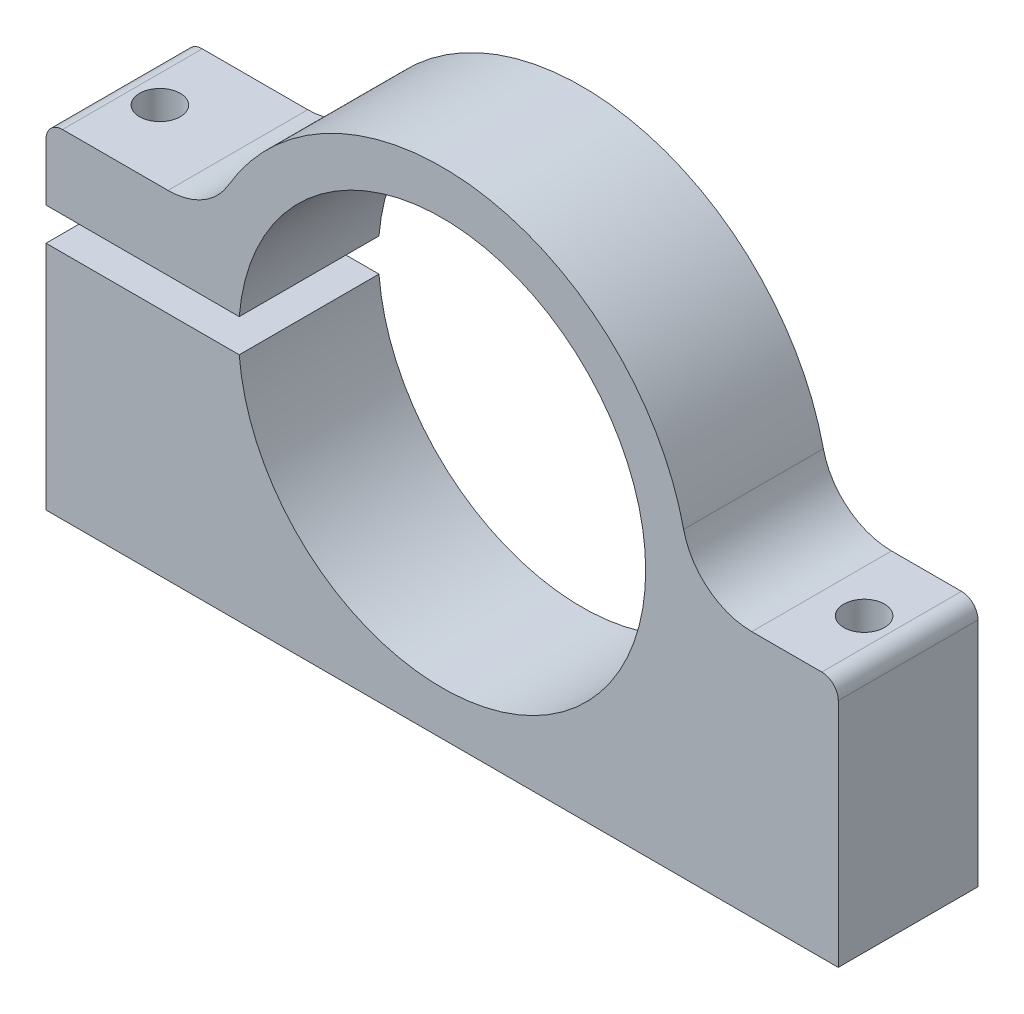
ISO-10303-21;
HEADER;
FILE_DESCRIPTION(('STEP AP214'),'2;1');
FILE_NAME('part.step','',(''),(''),'','','');
FILE_SCHEMA(('AUTOMOTIVE_DESIGN { 1 0 10303 214 1 1 1 1 }'));
ENDSEC;
DATA;
#1=APPLICATION_CONTEXT('core data for automotive mechanical design processes');
#2=APPLICATION_PROTOCOL_DEFINITION('international standard','automotive_design',2000,#1);
#3=PRODUCT_CONTEXT('',#1,'mechanical');
#4=PRODUCT('Part','Part','',(#3));
#5=PRODUCT_RELATED_PRODUCT_CATEGORY('part','',(#4));
#6=PRODUCT_DEFINITION_FORMATION('','',#4);
#7=PRODUCT_DEFINITION_CONTEXT('part definition',#1,'design');
#8=PRODUCT_DEFINITION('design','',#6,#7);
#9=PRODUCT_DEFINITION_SHAPE('','',#8);
#10=(LENGTH_UNIT() NAMED_UNIT(*) SI_UNIT(.MILLI.,.METRE.));
#11=(NAMED_UNIT(*) PLANE_ANGLE_UNIT() SI_UNIT($,.RADIAN.));
#12=(NAMED_UNIT(*) SI_UNIT($,.STERADIAN.) SOLID_ANGLE_UNIT());
#13=UNCERTAINTY_MEASURE_WITH_UNIT(LENGTH_MEASURE(1.E-05),#10,'distance_accuracy_value','');
#14=(GEOMETRIC_REPRESENTATION_CONTEXT(3) GLOBAL_UNCERTAINTY_ASSIGNED_CONTEXT((#13)) GLOBAL_UNIT_ASSIGNED_CONTEXT((#10,
#11,#12)) REPRESENTATION_CONTEXT('',''));
#15=CARTESIAN_POINT('',(0.,0.,0.));
#16=DIRECTION('',(0.,0.,1.));
#17=DIRECTION('',(1.,0.,0.));
#18=AXIS2_PLACEMENT_3D('',#15,#16,#17);
#19=CARTESIAN_POINT('',(-36.,8.2,-6.35));
#20=DIRECTION('',(-1.,0.,0.));
#21=DIRECTION('',(0.,0.,1.));
#22=AXIS2_PLACEMENT_3D('',#19,#20,#21);
#23=PLANE('',#22);
#24=DIRECTION('',(0.,0.,-1.));
#25=VECTOR('',#24,1.);
#26=CARTESIAN_POINT('',(-36.,-1.5,6.35));
#27=LINE('',#26,#25);
#28=CARTESIAN_POINT('',(-36.,-1.5,6.35));
#29=VERTEX_POINT('',#28);
#30=CARTESIAN_POINT('',(-36.,-1.5,-6.35));
#31=VERTEX_POINT('',#30);
#32=EDGE_CURVE('E154',#29,#31,#27,.T.);
#33=ORIENTED_EDGE('',*,*,#32,.T.);
#34=DIRECTION('',(0.,-1.,0.));
#35=VECTOR('',#34,1.);
#36=CARTESIAN_POINT('',(-36.,8.2,-6.35));
#37=LINE('',#36,#35);
#38=CARTESIAN_POINT('',(-36.,-22.5,-6.35));
#39=VERTEX_POINT('',#38);
#40=EDGE_CURVE('E191',#31,#39,#37,.T.);
#41=ORIENTED_EDGE('',*,*,#40,.T.);
#42=DIRECTION('',(0.,0.,1.));
#43=VECTOR('',#42,1.);
#44=CARTESIAN_POINT('',(-36.,-22.5,-6.35));
#45=LINE('',#44,#43);
#46=CARTESIAN_POINT('',(-36.,-22.5,6.35));
#47=VERTEX_POINT('',#46);
#48=EDGE_CURVE('E202',#39,#47,#45,.T.);
#49=ORIENTED_EDGE('',*,*,#48,.T.);
#50=DIRECTION('',(0.,-1.,0.));
#51=VECTOR('',#50,1.);
#52=CARTESIAN_POINT('',(-36.,8.2,6.35));
#53=LINE('',#52,#51);
#54=EDGE_CURVE('E206',#29,#47,#53,.T.);
#55=ORIENTED_EDGE('',*,*,#54,.F.);
#56=EDGE_LOOP('',(#33,#41,#49,#55));
#57=FACE_BOUND('',#56,.T.);
#58=ADVANCED_FACE('F44',(#57),#23,.T.);
#59=CARTESIAN_POINT('',(0.,0.,-6.35));
#60=DIRECTION('',(0.,0.,1.));
#61=DIRECTION('',(1.,0.,0.));
#62=AXIS2_PLACEMENT_3D('',#59,#60,#61);
#63=CYLINDRICAL_SURFACE('',#62,22.5);
#64=CARTESIAN_POINT('',(0.,0.,-6.35));
#65=DIRECTION('',(0.,0.,1.));
#66=DIRECTION('',(1.,0.,0.));
#67=AXIS2_PLACEMENT_3D('',#64,#65,#66);
#68=CIRCLE('',#67,22.5);
#69=CARTESIAN_POINT('',(21.9482193267301,4.95233968804159,-6.35));
#70=VERTEX_POINT('',#69);
#71=CARTESIAN_POINT('',(-19.4289613398529,11.3474870017331,-6.35));
#72=VERTEX_POINT('',#71);
#73=EDGE_CURVE('E185',#70,#72,#68,.T.);
#74=ORIENTED_EDGE('',*,*,#73,.T.);
#75=DIRECTION('',(0.,0.,1.));
#76=VECTOR('',#75,1.);
#77=CARTESIAN_POINT('',(-19.4289613398529,11.3474870017331,-6.35));
#78=LINE('',#77,#76);
#79=CARTESIAN_POINT('',(-19.4289613398529,11.3474870017331,6.35));
#80=VERTEX_POINT('',#79);
#81=EDGE_CURVE('E242',#72,#80,#78,.T.);
#82=ORIENTED_EDGE('',*,*,#81,.T.);
#83=CARTESIAN_POINT('',(0.,0.,6.35));
#84=DIRECTION('',(0.,0.,1.));
#85=DIRECTION('',(1.,0.,0.));
#86=AXIS2_PLACEMENT_3D('',#83,#84,#85);
#87=CIRCLE('',#86,22.5);
#88=CARTESIAN_POINT('',(21.9482193267301,4.95233968804159,6.35));
#89=VERTEX_POINT('',#88);
#90=EDGE_CURVE('E182',#89,#80,#87,.T.);
#91=ORIENTED_EDGE('',*,*,#90,.F.);
#92=DIRECTION('',(0.,0.,1.));
#93=VECTOR('',#92,1.);
#94=CARTESIAN_POINT('',(21.9482193267301,4.9523396880416,-6.35));
#95=LINE('',#94,#93);
#96=EDGE_CURVE('E240',#89,#70,#95,.F.);
#97=ORIENTED_EDGE('',*,*,#96,.T.);
#98=EDGE_LOOP('',(#74,#82,#91,#97));
#99=FACE_BOUND('',#98,.T.);
#100=ADVANCED_FACE('F255',(#99),#63,.T.);
#101=CARTESIAN_POINT('',(36.,0.,-6.35));
#102=DIRECTION('',(0.,1.,0.));
#103=DIRECTION('',(0.,0.,1.));
#104=AXIS2_PLACEMENT_3D('',#101,#102,#103);
#105=PLANE('',#104);
#106=CARTESIAN_POINT('',(32.,0.,0.));
#107=DIRECTION('',(0.,1.,0.));
#108=DIRECTION('',(0.,0.,1.));
#109=AXIS2_PLACEMENT_3D('',#106,#107,#108);
#110=CIRCLE('',#109,1.84999999999999);
#111=CARTESIAN_POINT('',(32.,0.,1.84999999999999));
#112=VERTEX_POINT('',#111);
#113=EDGE_CURVE('E320',#112,#112,#110,.T.);
#114=ORIENTED_EDGE('',*,*,#113,.F.);
#115=EDGE_LOOP('',(#114));
#116=FACE_BOUND('',#115,.T.);
#117=DIRECTION('',(-1.,0.,0.));
#118=VECTOR('',#117,1.);
#119=CARTESIAN_POINT('',(36.,0.,-6.35));
#120=LINE('',#119,#118);
#121=CARTESIAN_POINT('',(34.5,0.,-6.35));
#122=VERTEX_POINT('',#121);
#123=CARTESIAN_POINT('',(28.1424945589406,0.,-6.35));
#124=VERTEX_POINT('',#123);
#125=EDGE_CURVE('E200',#122,#124,#120,.T.);
#126=ORIENTED_EDGE('',*,*,#125,.T.);
#127=DIRECTION('',(0.,0.,-1.));
#128=VECTOR('',#127,1.);
#129=CARTESIAN_POINT('',(28.1424945589406,0.,6.35));
#130=LINE('',#129,#128);
#131=CARTESIAN_POINT('',(28.1424945589406,0.,6.35));
#132=VERTEX_POINT('',#131);
#133=EDGE_CURVE('E247',#124,#132,#130,.F.);
#134=ORIENTED_EDGE('',*,*,#133,.T.);
#135=DIRECTION('',(-1.,0.,0.));
#136=VECTOR('',#135,1.);
#137=CARTESIAN_POINT('',(36.,0.,6.35));
#138=LINE('',#137,#136);
#139=CARTESIAN_POINT('',(34.5,0.,6.35));
#140=VERTEX_POINT('',#139);
#141=EDGE_CURVE('E189',#140,#132,#138,.T.);
#142=ORIENTED_EDGE('',*,*,#141,.F.);
#143=DIRECTION('',(0.,0.,1.));
#144=VECTOR('',#143,1.);
#145=CARTESIAN_POINT('',(34.5,0.,-6.35));
#146=LINE('',#145,#144);
#147=EDGE_CURVE('E238',#140,#122,#146,.F.);
#148=ORIENTED_EDGE('',*,*,#147,.T.);
#149=EDGE_LOOP('',(#126,#134,#142,#148));
#150=FACE_BOUND('',#149,.T.);
#151=ADVANCED_FACE('F258',(#116,#150),#105,.T.);
#152=CARTESIAN_POINT('',(36.,-22.5,-6.35));
#153=DIRECTION('',(1.,0.,0.));
#154=DIRECTION('',(0.,0.,-1.));
#155=AXIS2_PLACEMENT_3D('',#152,#153,#154);
#156=PLANE('',#155);
#157=DIRECTION('',(0.,1.,0.));
#158=VECTOR('',#157,1.);
#159=CARTESIAN_POINT('',(36.,-22.5,-6.35));
#160=LINE('',#159,#158);
#161=CARTESIAN_POINT('',(36.,-22.5,-6.35));
#162=VERTEX_POINT('',#161);
#163=CARTESIAN_POINT('',(36.,-1.50000000000001,-6.35));
#164=VERTEX_POINT('',#163);
#165=EDGE_CURVE('E197',#162,#164,#160,.T.);
#166=ORIENTED_EDGE('',*,*,#165,.T.);
#167=DIRECTION('',(0.,0.,1.));
#168=VECTOR('',#167,1.);
#169=CARTESIAN_POINT('',(36.,-1.5,-6.35));
#170=LINE('',#169,#168);
#171=CARTESIAN_POINT('',(36.,-1.50000000000001,6.35));
#172=VERTEX_POINT('',#171);
#173=EDGE_CURVE('E235',#164,#172,#170,.T.);
#174=ORIENTED_EDGE('',*,*,#173,.T.);
#175=DIRECTION('',(0.,1.,0.));
#176=VECTOR('',#175,1.);
#177=CARTESIAN_POINT('',(36.,-22.5,6.35));
#178=LINE('',#177,#176);
#179=CARTESIAN_POINT('',(36.,-22.5,6.35));
#180=VERTEX_POINT('',#179);
#181=EDGE_CURVE('E212',#180,#172,#178,.T.);
#182=ORIENTED_EDGE('',*,*,#181,.F.);
#183=DIRECTION('',(0.,0.,1.));
#184=VECTOR('',#183,1.);
#185=CARTESIAN_POINT('',(36.,-22.5,-6.35));
#186=LINE('',#185,#184);
#187=EDGE_CURVE('E217',#162,#180,#186,.T.);
#188=ORIENTED_EDGE('',*,*,#187,.F.);
#189=EDGE_LOOP('',(#166,#174,#182,#188));
#190=FACE_BOUND('',#189,.T.);
#191=ADVANCED_FACE('F269',(#190),#156,.T.);
#192=CARTESIAN_POINT('',(-36.,-22.5,-6.35));
#193=DIRECTION('',(0.,-1.,0.));
#194=DIRECTION('',(0.,0.,-1.));
#195=AXIS2_PLACEMENT_3D('',#192,#193,#194);
#196=PLANE('',#195);
#197=CARTESIAN_POINT('',(32.,-22.5,0.));
#198=DIRECTION('',(0.,-1.,0.));
#199=DIRECTION('',(0.,0.,-1.));
#200=AXIS2_PLACEMENT_3D('',#197,#198,#199);
#201=CIRCLE('',#200,1.84999999999999);
#202=CARTESIAN_POINT('',(32.,-22.5,-1.84999999999999));
#203=VERTEX_POINT('',#202);
#204=EDGE_CURVE('E323',#203,#203,#201,.T.);
#205=ORIENTED_EDGE('',*,*,#204,.F.);
#206=EDGE_LOOP('',(#205));
#207=FACE_BOUND('',#206,.T.);
#208=CARTESIAN_POINT('',(-32.,-22.5,0.));
#209=DIRECTION('',(0.,-1.,0.));
#210=DIRECTION('',(0.,0.,-1.));
#211=AXIS2_PLACEMENT_3D('',#208,#209,#210);
#212=CIRCLE('',#211,1.84999999999999);
#213=CARTESIAN_POINT('',(-32.,-22.5,-1.84999999999999));
#214=VERTEX_POINT('',#213);
#215=EDGE_CURVE('E317',#214,#214,#212,.T.);
#216=ORIENTED_EDGE('',*,*,#215,.F.);
#217=EDGE_LOOP('',(#216));
#218=FACE_BOUND('',#217,.T.);
#219=DIRECTION('',(1.,0.,0.));
#220=VECTOR('',#219,1.);
#221=CARTESIAN_POINT('',(-36.,-22.5,6.35));
#222=LINE('',#221,#220);
#223=EDGE_CURVE('E209',#47,#180,#222,.T.);
#224=ORIENTED_EDGE('',*,*,#223,.F.);
#225=ORIENTED_EDGE('',*,*,#48,.F.);
#226=DIRECTION('',(1.,0.,0.));
#227=VECTOR('',#226,1.);
#228=CARTESIAN_POINT('',(-36.,-22.5,-6.35));
#229=LINE('',#228,#227);
#230=EDGE_CURVE('E194',#39,#162,#229,.T.);
#231=ORIENTED_EDGE('',*,*,#230,.T.);
#232=ORIENTED_EDGE('',*,*,#187,.T.);
#233=EDGE_LOOP('',(#224,#225,#231,#232));
#234=FACE_BOUND('',#233,.T.);
#235=ADVANCED_FACE('F273',(#207,#218,#234),#196,.T.);
#236=CARTESIAN_POINT('',(-36.,6.7,6.35));
#237=VERTEX_POINT('',#236);
#238=CARTESIAN_POINT('',(-36.,1.5,6.35));
#239=VERTEX_POINT('',#238);
#240=EDGE_CURVE('E207',#237,#239,#53,.T.);
#241=ORIENTED_EDGE('',*,*,#240,.F.);
#242=DIRECTION('',(0.,0.,1.));
#243=VECTOR('',#242,1.);
#244=CARTESIAN_POINT('',(-36.,6.7,-6.35));
#245=LINE('',#244,#243);
#246=CARTESIAN_POINT('',(-36.,6.7,-6.35));
#247=VERTEX_POINT('',#246);
#248=EDGE_CURVE('E228',#237,#247,#245,.F.);
#249=ORIENTED_EDGE('',*,*,#248,.T.);
#250=CARTESIAN_POINT('',(-36.,1.5,-6.35));
#251=VERTEX_POINT('',#250);
#252=EDGE_CURVE('E192',#247,#251,#37,.T.);
#253=ORIENTED_EDGE('',*,*,#252,.T.);
#254=DIRECTION('',(0.,0.,-1.));
#255=VECTOR('',#254,1.);
#256=CARTESIAN_POINT('',(-36.,1.5,6.35));
#257=LINE('',#256,#255);
#258=EDGE_CURVE('E170',#239,#251,#257,.T.);
#259=ORIENTED_EDGE('',*,*,#258,.F.);
#260=EDGE_LOOP('',(#241,#249,#253,#259));
#261=FACE_BOUND('',#260,.T.);
#262=ADVANCED_FACE('F279',(#261),#23,.T.);
#263=CARTESIAN_POINT('',(-20.9525654753779,8.2,-6.35));
#264=DIRECTION('',(0.,1.,0.));
#265=DIRECTION('',(0.,0.,1.));
#266=AXIS2_PLACEMENT_3D('',#263,#264,#265);
#267=PLANE('',#266);
#268=CARTESIAN_POINT('',(-32.,8.2,0.));
#269=DIRECTION('',(0.,1.,0.));
#270=DIRECTION('',(0.,0.,1.));
#271=AXIS2_PLACEMENT_3D('',#268,#269,#270);
#272=CIRCLE('',#271,1.84999999999999);
#273=CARTESIAN_POINT('',(-32.,8.2,1.84999999999999));
#274=VERTEX_POINT('',#273);
#275=EDGE_CURVE('E311',#274,#274,#272,.T.);
#276=ORIENTED_EDGE('',*,*,#275,.F.);
#277=EDGE_LOOP('',(#276));
#278=FACE_BOUND('',#277,.T.);
#279=DIRECTION('',(-1.,0.,0.));
#280=VECTOR('',#279,1.);
#281=CARTESIAN_POINT('',(-20.9525654753779,8.2,6.35));
#282=LINE('',#281,#280);
#283=CARTESIAN_POINT('',(-24.9122459846558,8.2,6.35));
#284=VERTEX_POINT('',#283);
#285=CARTESIAN_POINT('',(-34.5,8.2,6.35));
#286=VERTEX_POINT('',#285);
#287=EDGE_CURVE('E204',#284,#286,#282,.T.);
#288=ORIENTED_EDGE('',*,*,#287,.F.);
#289=DIRECTION('',(0.,0.,-1.));
#290=VECTOR('',#289,1.);
#291=CARTESIAN_POINT('',(-24.9122459846558,8.2,-6.35));
#292=LINE('',#291,#290);
#293=CARTESIAN_POINT('',(-24.9122459846558,8.2,-6.35));
#294=VERTEX_POINT('',#293);
#295=EDGE_CURVE('E245',#284,#294,#292,.T.);
#296=ORIENTED_EDGE('',*,*,#295,.T.);
#297=DIRECTION('',(-1.,0.,0.));
#298=VECTOR('',#297,1.);
#299=CARTESIAN_POINT('',(-20.9525654753779,8.2,-6.35));
#300=LINE('',#299,#298);
#301=CARTESIAN_POINT('',(-34.5,8.2,-6.35));
#302=VERTEX_POINT('',#301);
#303=EDGE_CURVE('E188',#294,#302,#300,.T.);
#304=ORIENTED_EDGE('',*,*,#303,.T.);
#305=DIRECTION('',(0.,0.,1.));
#306=VECTOR('',#305,1.);
#307=CARTESIAN_POINT('',(-34.5,8.2,-6.35));
#308=LINE('',#307,#306);
#309=EDGE_CURVE('E219',#302,#286,#308,.T.);
#310=ORIENTED_EDGE('',*,*,#309,.T.);
#311=EDGE_LOOP('',(#288,#296,#304,#310));
#312=FACE_BOUND('',#311,.T.);
#313=ADVANCED_FACE('F287',(#278,#312),#267,.T.);
#314=CARTESIAN_POINT('',(0.,0.,-6.35));
#315=DIRECTION('',(0.,0.,1.));
#316=DIRECTION('',(1.,0.,0.));
#317=AXIS2_PLACEMENT_3D('',#314,#315,#316);
#318=PLANE('',#317);
#319=ORIENTED_EDGE('',*,*,#252,.F.);
#320=CARTESIAN_POINT('',(-34.5,6.7,-6.35));
#321=DIRECTION('',(0.,0.,1.));
#322=DIRECTION('',(1.,0.,0.));
#323=AXIS2_PLACEMENT_3D('',#320,#321,#322);
#324=CIRCLE('',#323,1.5);
#325=EDGE_CURVE('E232',#247,#302,#324,.F.);
#326=ORIENTED_EDGE('',*,*,#325,.T.);
#327=ORIENTED_EDGE('',*,*,#303,.F.);
#328=CARTESIAN_POINT('',(-24.9122459846558,14.55,-6.35));
#329=DIRECTION('',(0.,0.,1.));
#330=DIRECTION('',(1.,0.,0.));
#331=AXIS2_PLACEMENT_3D('',#328,#329,#330);
#332=CIRCLE('',#331,6.35);
#333=EDGE_CURVE('E251',#294,#72,#332,.T.);
#334=ORIENTED_EDGE('',*,*,#333,.T.);
#335=ORIENTED_EDGE('',*,*,#73,.F.);
#336=CARTESIAN_POINT('',(28.1424945589406,6.35,-6.35));
#337=DIRECTION('',(0.,0.,1.));
#338=DIRECTION('',(1.,0.,0.));
#339=AXIS2_PLACEMENT_3D('',#336,#337,#338);
#340=CIRCLE('',#339,6.35);
#341=EDGE_CURVE('E13',#70,#124,#340,.T.);
#342=ORIENTED_EDGE('',*,*,#341,.T.);
#343=ORIENTED_EDGE('',*,*,#125,.F.);
#344=CARTESIAN_POINT('',(34.5,-1.5,-6.35));
#345=DIRECTION('',(0.,0.,1.));
#346=DIRECTION('',(1.,0.,0.));
#347=AXIS2_PLACEMENT_3D('',#344,#345,#346);
#348=CIRCLE('',#347,1.5);
#349=EDGE_CURVE('E230',#122,#164,#348,.F.);
#350=ORIENTED_EDGE('',*,*,#349,.T.);
#351=ORIENTED_EDGE('',*,*,#165,.F.);
#352=ORIENTED_EDGE('',*,*,#230,.F.);
#353=ORIENTED_EDGE('',*,*,#40,.F.);
#354=DIRECTION('',(-1.,0.,0.));
#355=VECTOR('',#354,1.);
#356=CARTESIAN_POINT('',(-18.4390889145858,-1.49999999999983,-6.35));
#357=LINE('',#356,#355);
#358=CARTESIAN_POINT('',(-18.4390889145858,-1.49999999999983,-6.35));
#359=VERTEX_POINT('',#358);
#360=EDGE_CURVE('E174',#359,#31,#357,.T.);
#361=ORIENTED_EDGE('',*,*,#360,.F.);
#362=CARTESIAN_POINT('',(0.,0.,-6.35));
#363=DIRECTION('',(0.,0.,1.));
#364=DIRECTION('',(1.,0.,0.));
#365=AXIS2_PLACEMENT_3D('',#362,#363,#364);
#366=CIRCLE('',#365,18.5);
#367=CARTESIAN_POINT('',(-18.4390889145858,1.49999999999983,-6.35));
#368=VERTEX_POINT('',#367);
#369=EDGE_CURVE('E150',#359,#368,#366,.T.);
#370=ORIENTED_EDGE('',*,*,#369,.T.);
#371=DIRECTION('',(1.,0.,0.));
#372=VECTOR('',#371,1.);
#373=CARTESIAN_POINT('',(-36.,1.5,-6.35));
#374=LINE('',#373,#372);
#375=EDGE_CURVE('E178',#251,#368,#374,.T.);
#376=ORIENTED_EDGE('',*,*,#375,.F.);
#377=EDGE_LOOP('',(#319,#326,#327,#334,#335,#342,#343,#350,#351,#352,#353,#361,#370,#376));
#378=FACE_BOUND('',#377,.T.);
#379=ADVANCED_FACE('F262',(#378),#318,.F.);
#380=CARTESIAN_POINT('',(0.,0.,6.35));
#381=DIRECTION('',(0.,0.,1.));
#382=DIRECTION('',(1.,0.,0.));
#383=AXIS2_PLACEMENT_3D('',#380,#381,#382);
#384=PLANE('',#383);
#385=ORIENTED_EDGE('',*,*,#90,.T.);
#386=CARTESIAN_POINT('',(-24.9122459846558,14.55,6.35));
#387=DIRECTION('',(0.,0.,1.));
#388=DIRECTION('',(1.,0.,0.));
#389=AXIS2_PLACEMENT_3D('',#386,#387,#388);
#390=CIRCLE('',#389,6.35);
#391=EDGE_CURVE('E249',#80,#284,#390,.F.);
#392=ORIENTED_EDGE('',*,*,#391,.T.);
#393=ORIENTED_EDGE('',*,*,#287,.T.);
#394=CARTESIAN_POINT('',(-34.5,6.7,6.35));
#395=DIRECTION('',(0.,0.,1.));
#396=DIRECTION('',(1.,0.,0.));
#397=AXIS2_PLACEMENT_3D('',#394,#395,#396);
#398=CIRCLE('',#397,1.5);
#399=EDGE_CURVE('E226',#286,#237,#398,.T.);
#400=ORIENTED_EDGE('',*,*,#399,.T.);
#401=ORIENTED_EDGE('',*,*,#240,.T.);
#402=DIRECTION('',(1.,0.,0.));
#403=VECTOR('',#402,1.);
#404=CARTESIAN_POINT('',(-36.,1.5,6.35));
#405=LINE('',#404,#403);
#406=CARTESIAN_POINT('',(-18.4390889145858,1.49999999999983,6.35));
#407=VERTEX_POINT('',#406);
#408=EDGE_CURVE('E165',#239,#407,#405,.T.);
#409=ORIENTED_EDGE('',*,*,#408,.T.);
#410=CARTESIAN_POINT('',(0.,0.,6.35));
#411=DIRECTION('',(0.,0.,1.));
#412=DIRECTION('',(1.,0.,0.));
#413=AXIS2_PLACEMENT_3D('',#410,#411,#412);
#414=CIRCLE('',#413,18.5);
#415=CARTESIAN_POINT('',(-18.4390889145858,-1.49999999999983,6.35));
#416=VERTEX_POINT('',#415);
#417=EDGE_CURVE('E147',#416,#407,#414,.T.);
#418=ORIENTED_EDGE('',*,*,#417,.F.);
#419=DIRECTION('',(-1.,0.,0.));
#420=VECTOR('',#419,1.);
#421=CARTESIAN_POINT('',(-18.4390889145858,-1.49999999999983,6.35));
#422=LINE('',#421,#420);
#423=EDGE_CURVE('E162',#416,#29,#422,.T.);
#424=ORIENTED_EDGE('',*,*,#423,.T.);
#425=ORIENTED_EDGE('',*,*,#54,.T.);
#426=ORIENTED_EDGE('',*,*,#223,.T.);
#427=ORIENTED_EDGE('',*,*,#181,.T.);
#428=CARTESIAN_POINT('',(34.5,-1.5,6.35));
#429=DIRECTION('',(0.,0.,1.));
#430=DIRECTION('',(1.,0.,0.));
#431=AXIS2_PLACEMENT_3D('',#428,#429,#430);
#432=CIRCLE('',#431,1.5);
#433=EDGE_CURVE('E224',#172,#140,#432,.T.);
#434=ORIENTED_EDGE('',*,*,#433,.T.);
#435=ORIENTED_EDGE('',*,*,#141,.T.);
#436=CARTESIAN_POINT('',(28.1424945589406,6.35,6.35));
#437=DIRECTION('',(0.,0.,1.));
#438=DIRECTION('',(1.,0.,0.));
#439=AXIS2_PLACEMENT_3D('',#436,#437,#438);
#440=CIRCLE('',#439,6.35);
#441=EDGE_CURVE('E52',#132,#89,#440,.F.);
#442=ORIENTED_EDGE('',*,*,#441,.T.);
#443=EDGE_LOOP('',(#385,#392,#393,#400,#401,#409,#418,#424,#425,#426,#427,#434,#435,#442));
#444=FACE_BOUND('',#443,.T.);
#445=ADVANCED_FACE('F161',(#444),#384,.T.);
#446=CARTESIAN_POINT('',(-18.4390889145858,-1.49999999999983,6.35));
#447=DIRECTION('',(0.,-1.,0.));
#448=DIRECTION('',(1.,0.,0.));
#449=AXIS2_PLACEMENT_3D('',#446,#447,#448);
#450=PLANE('',#449);
#451=CARTESIAN_POINT('',(-32.,-1.49999999999996,0.));
#452=DIRECTION('',(0.,-1.,0.));
#453=DIRECTION('',(1.,0.,0.));
#454=AXIS2_PLACEMENT_3D('',#451,#452,#453);
#455=CIRCLE('',#454,1.84999999999999);
#456=CARTESIAN_POINT('',(-30.15,-1.49999999999994,0.));
#457=VERTEX_POINT('',#456);
#458=EDGE_CURVE('E314',#457,#457,#455,.T.);
#459=ORIENTED_EDGE('',*,*,#458,.T.);
#460=EDGE_LOOP('',(#459));
#461=FACE_BOUND('',#460,.T.);
#462=ORIENTED_EDGE('',*,*,#360,.T.);
#463=ORIENTED_EDGE('',*,*,#32,.F.);
#464=ORIENTED_EDGE('',*,*,#423,.F.);
#465=DIRECTION('',(0.,0.,-1.));
#466=VECTOR('',#465,1.);
#467=CARTESIAN_POINT('',(-18.4390889145858,-1.49999999999983,6.35));
#468=LINE('',#467,#466);
#469=EDGE_CURVE('E144',#416,#359,#468,.T.);
#470=ORIENTED_EDGE('',*,*,#469,.T.);
#471=EDGE_LOOP('',(#462,#463,#464,#470));
#472=FACE_BOUND('',#471,.T.);
#473=ADVANCED_FACE('F168',(#461,#472),#450,.F.);
#474=CARTESIAN_POINT('',(-36.,1.5,6.35));
#475=DIRECTION('',(0.,1.,0.));
#476=DIRECTION('',(-1.,0.,0.));
#477=AXIS2_PLACEMENT_3D('',#474,#475,#476);
#478=PLANE('',#477);
#479=CARTESIAN_POINT('',(-32.,1.49999999999996,0.));
#480=DIRECTION('',(0.,1.,0.));
#481=DIRECTION('',(-1.,0.,0.));
#482=AXIS2_PLACEMENT_3D('',#479,#480,#481);
#483=CIRCLE('',#482,1.84999999999999);
#484=CARTESIAN_POINT('',(-33.85,1.49999999999998,0.));
#485=VERTEX_POINT('',#484);
#486=EDGE_CURVE('E166',#485,#485,#483,.T.);
#487=ORIENTED_EDGE('',*,*,#486,.T.);
#488=EDGE_LOOP('',(#487));
#489=FACE_BOUND('',#488,.T.);
#490=ORIENTED_EDGE('',*,*,#375,.T.);
#491=DIRECTION('',(0.,0.,-1.));
#492=VECTOR('',#491,1.);
#493=CARTESIAN_POINT('',(-18.4390889145858,1.49999999999983,6.35));
#494=LINE('',#493,#492);
#495=EDGE_CURVE('E155',#407,#368,#494,.T.);
#496=ORIENTED_EDGE('',*,*,#495,.F.);
#497=ORIENTED_EDGE('',*,*,#408,.F.);
#498=ORIENTED_EDGE('',*,*,#258,.T.);
#499=EDGE_LOOP('',(#490,#496,#497,#498));
#500=FACE_BOUND('',#499,.T.);
#501=ADVANCED_FACE('F307',(#489,#500),#478,.F.);
#502=CARTESIAN_POINT('',(0.,0.,-6.35));
#503=DIRECTION('',(0.,0.,1.));
#504=DIRECTION('',(1.,0.,0.));
#505=AXIS2_PLACEMENT_3D('',#502,#503,#504);
#506=CYLINDRICAL_SURFACE('',#505,18.5);
#507=ORIENTED_EDGE('',*,*,#417,.T.);
#508=ORIENTED_EDGE('',*,*,#495,.T.);
#509=ORIENTED_EDGE('',*,*,#369,.F.);
#510=ORIENTED_EDGE('',*,*,#469,.F.);
#511=EDGE_LOOP('',(#507,#508,#509,#510));
#512=FACE_BOUND('',#511,.T.);
#513=ADVANCED_FACE('F146',(#512),#506,.F.);
#514=CARTESIAN_POINT('',(-32.,8.2,0.));
#515=DIRECTION('',(0.,1.,0.));
#516=DIRECTION('',(0.,0.,1.));
#517=AXIS2_PLACEMENT_3D('',#514,#515,#516);
#518=CYLINDRICAL_SURFACE('',#517,1.84999999999999);
#519=ORIENTED_EDGE('',*,*,#486,.F.);
#520=EDGE_LOOP('',(#519));
#521=FACE_BOUND('',#520,.T.);
#522=ORIENTED_EDGE('',*,*,#275,.T.);
#523=EDGE_LOOP('',(#522));
#524=FACE_BOUND('',#523,.T.);
#525=ADVANCED_FACE('F334',(#521,#524),#518,.F.);
#526=CARTESIAN_POINT('',(-32.,-22.5,0.));
#527=DIRECTION('',(0.,-1.,0.));
#528=DIRECTION('',(0.,0.,-1.));
#529=AXIS2_PLACEMENT_3D('',#526,#527,#528);
#530=CYLINDRICAL_SURFACE('',#529,1.84999999999999);
#531=ORIENTED_EDGE('',*,*,#215,.T.);
#532=EDGE_LOOP('',(#531));
#533=FACE_BOUND('',#532,.T.);
#534=ORIENTED_EDGE('',*,*,#458,.F.);
#535=EDGE_LOOP('',(#534));
#536=FACE_BOUND('',#535,.T.);
#537=ADVANCED_FACE('F331',(#533,#536),#530,.F.);
#538=CARTESIAN_POINT('',(32.,-22.5,0.));
#539=DIRECTION('',(0.,-1.,0.));
#540=DIRECTION('',(0.,0.,-1.));
#541=AXIS2_PLACEMENT_3D('',#538,#539,#540);
#542=CYLINDRICAL_SURFACE('',#541,1.84999999999999);
#543=ORIENTED_EDGE('',*,*,#113,.T.);
#544=EDGE_LOOP('',(#543));
#545=FACE_BOUND('',#544,.T.);
#546=ORIENTED_EDGE('',*,*,#204,.T.);
#547=EDGE_LOOP('',(#546));
#548=FACE_BOUND('',#547,.T.);
#549=ADVANCED_FACE('F327',(#545,#548),#542,.F.);
#550=CARTESIAN_POINT('',(-34.5,6.7,-6.35));
#551=DIRECTION('',(0.,0.,1.));
#552=DIRECTION('',(1.,0.,0.));
#553=AXIS2_PLACEMENT_3D('',#550,#551,#552);
#554=CYLINDRICAL_SURFACE('',#553,1.5);
#555=ORIENTED_EDGE('',*,*,#325,.F.);
#556=ORIENTED_EDGE('',*,*,#248,.F.);
#557=ORIENTED_EDGE('',*,*,#399,.F.);
#558=ORIENTED_EDGE('',*,*,#309,.F.);
#559=EDGE_LOOP('',(#555,#556,#557,#558));
#560=FACE_BOUND('',#559,.T.);
#561=ADVANCED_FACE('F301',(#560),#554,.T.);
#562=CARTESIAN_POINT('',(34.5,-1.5,-6.35));
#563=DIRECTION('',(0.,0.,1.));
#564=DIRECTION('',(1.,0.,0.));
#565=AXIS2_PLACEMENT_3D('',#562,#563,#564);
#566=CYLINDRICAL_SURFACE('',#565,1.5);
#567=ORIENTED_EDGE('',*,*,#349,.F.);
#568=ORIENTED_EDGE('',*,*,#147,.F.);
#569=ORIENTED_EDGE('',*,*,#433,.F.);
#570=ORIENTED_EDGE('',*,*,#173,.F.);
#571=EDGE_LOOP('',(#567,#568,#569,#570));
#572=FACE_BOUND('',#571,.T.);
#573=ADVANCED_FACE('F266',(#572),#566,.T.);
#574=CARTESIAN_POINT('',(-24.9122459846558,14.55,-6.35));
#575=DIRECTION('',(0.,0.,1.));
#576=DIRECTION('',(1.,0.,0.));
#577=AXIS2_PLACEMENT_3D('',#574,#575,#576);
#578=CYLINDRICAL_SURFACE('',#577,6.35);
#579=ORIENTED_EDGE('',*,*,#333,.F.);
#580=ORIENTED_EDGE('',*,*,#295,.F.);
#581=ORIENTED_EDGE('',*,*,#391,.F.);
#582=ORIENTED_EDGE('',*,*,#81,.F.);
#583=EDGE_LOOP('',(#579,#580,#581,#582));
#584=FACE_BOUND('',#583,.T.);
#585=ADVANCED_FACE('F393',(#584),#578,.F.);
#586=CARTESIAN_POINT('',(28.1424945589406,6.35,-6.35));
#587=DIRECTION('',(0.,0.,1.));
#588=DIRECTION('',(1.,0.,0.));
#589=AXIS2_PLACEMENT_3D('',#586,#587,#588);
#590=CYLINDRICAL_SURFACE('',#589,6.35);
#591=ORIENTED_EDGE('',*,*,#341,.F.);
#592=ORIENTED_EDGE('',*,*,#96,.F.);
#593=ORIENTED_EDGE('',*,*,#441,.F.);
#594=ORIENTED_EDGE('',*,*,#133,.F.);
#595=EDGE_LOOP('',(#591,#592,#593,#594));
#596=FACE_BOUND('',#595,.T.);
#597=ADVANCED_FACE('F46',(#596),#590,.F.);
#598=CLOSED_SHELL('',(#58,#100,#151,#191,#235,#262,#313,#379,#445,#473,#501,#513,#525,#537,#549,
#561,#573,#585,#597));
#599=MANIFOLD_SOLID_BREP('B2',#598);
#600=ADVANCED_BREP_SHAPE_REPRESENTATION('',(#18,#599),#14);
#601=SHAPE_DEFINITION_REPRESENTATION(#9,#600);
ENDSEC;
END-ISO-10303-21;
